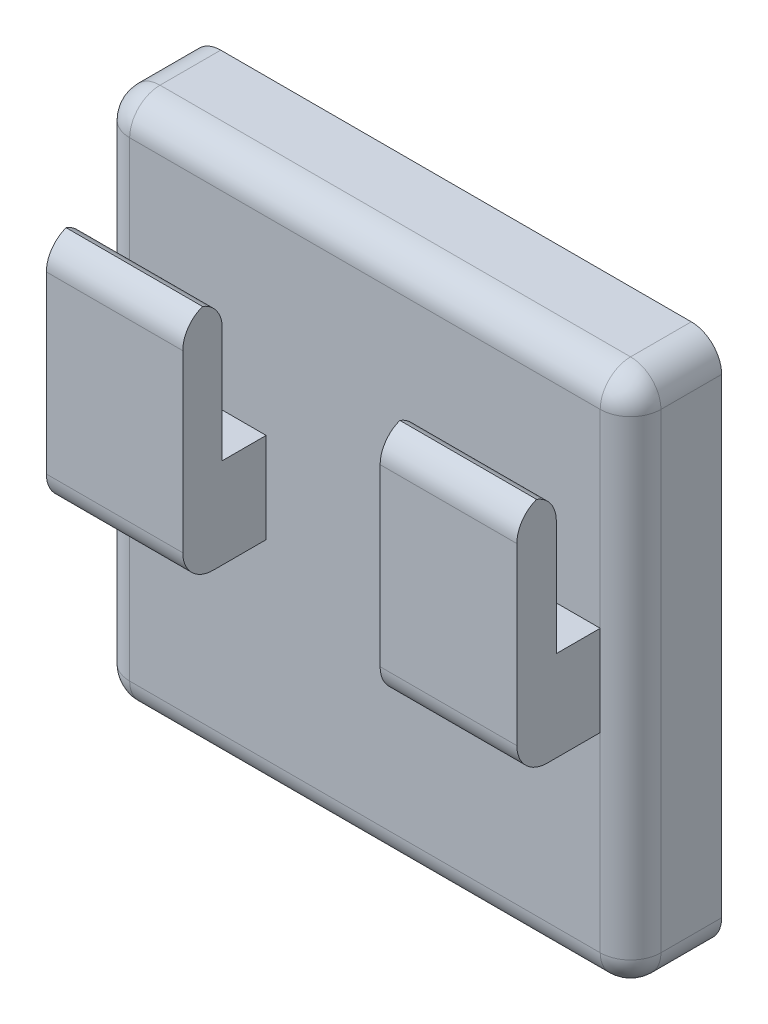
ISO-10303-21;
HEADER;
FILE_DESCRIPTION(('STEP AP214'),'2;1');
FILE_NAME('part.step','',(''),(''),'','','');
FILE_SCHEMA(('AUTOMOTIVE_DESIGN { 1 0 10303 214 1 1 1 1 }'));
ENDSEC;
DATA;
#1=APPLICATION_CONTEXT('core data for automotive mechanical design processes');
#2=APPLICATION_PROTOCOL_DEFINITION('international standard','automotive_design',2000,#1);
#3=PRODUCT_CONTEXT('',#1,'mechanical');
#4=PRODUCT('Part','Part','',(#3));
#5=PRODUCT_RELATED_PRODUCT_CATEGORY('part','',(#4));
#6=PRODUCT_DEFINITION_FORMATION('','',#4);
#7=PRODUCT_DEFINITION_CONTEXT('part definition',#1,'design');
#8=PRODUCT_DEFINITION('design','',#6,#7);
#9=PRODUCT_DEFINITION_SHAPE('','',#8);
#10=(LENGTH_UNIT() NAMED_UNIT(*) SI_UNIT(.MILLI.,.METRE.));
#11=(NAMED_UNIT(*) PLANE_ANGLE_UNIT() SI_UNIT($,.RADIAN.));
#12=(NAMED_UNIT(*) SI_UNIT($,.STERADIAN.) SOLID_ANGLE_UNIT());
#13=UNCERTAINTY_MEASURE_WITH_UNIT(LENGTH_MEASURE(1.E-05),#10,'distance_accuracy_value','');
#14=(GEOMETRIC_REPRESENTATION_CONTEXT(3) GLOBAL_UNCERTAINTY_ASSIGNED_CONTEXT((#13)) GLOBAL_UNIT_ASSIGNED_CONTEXT((#10,
#11,#12)) REPRESENTATION_CONTEXT('',''));
#15=CARTESIAN_POINT('',(0.,0.,0.));
#16=DIRECTION('',(0.,0.,1.));
#17=DIRECTION('',(1.,0.,0.));
#18=AXIS2_PLACEMENT_3D('',#15,#16,#17);
#19=CARTESIAN_POINT('',(44.45,34.4782802108625,0.));
#20=DIRECTION('',(0.,-1.,0.));
#21=DIRECTION('',(0.,0.,-1.));
#22=AXIS2_PLACEMENT_3D('',#19,#20,#21);
#23=PLANE('',#22);
#24=DIRECTION('',(0.,0.,1.));
#25=VECTOR('',#24,1.);
#26=CARTESIAN_POINT('',(13.958752929952,34.4782802108625,0.));
#27=LINE('',#26,#25);
#28=CARTESIAN_POINT('',(13.958752929952,34.4782802108625,11.7617244409826));
#29=VERTEX_POINT('',#28);
#30=CARTESIAN_POINT('',(13.958752929952,34.4782802108625,15.434687804273));
#31=VERTEX_POINT('',#30);
#32=EDGE_CURVE('E398',#29,#31,#27,.T.);
#33=ORIENTED_EDGE('',*,*,#32,.F.);
#34=DIRECTION('',(-1.,0.,0.));
#35=VECTOR('',#34,1.);
#36=CARTESIAN_POINT('',(44.45,34.4782802108625,11.7617244409826));
#37=LINE('',#36,#35);
#38=CARTESIAN_POINT('',(2.54496675491406,34.4782802108625,11.7617244409826));
#39=VERTEX_POINT('',#38);
#40=EDGE_CURVE('E249',#29,#39,#37,.T.);
#41=ORIENTED_EDGE('',*,*,#40,.T.);
#42=DIRECTION('',(0.,0.,-1.));
#43=VECTOR('',#42,1.);
#44=CARTESIAN_POINT('',(2.54496675491406,34.4782802108625,0.));
#45=LINE('',#44,#43);
#46=CARTESIAN_POINT('',(2.54496675491406,34.4782802108625,15.434687804273));
#47=VERTEX_POINT('',#46);
#48=EDGE_CURVE('E403',#47,#39,#45,.T.);
#49=ORIENTED_EDGE('',*,*,#48,.F.);
#50=DIRECTION('',(-1.,0.,0.));
#51=VECTOR('',#50,1.);
#52=CARTESIAN_POINT('',(44.45,34.4782802108625,15.434687804273));
#53=LINE('',#52,#51);
#54=EDGE_CURVE('E236',#31,#47,#53,.T.);
#55=ORIENTED_EDGE('',*,*,#54,.F.);
#56=EDGE_LOOP('',(#33,#41,#49,#55));
#57=FACE_BOUND('',#56,.T.);
#58=ADVANCED_FACE('F36',(#57),#23,.F.);
#59=DIRECTION('',(0.,0.,-1.));
#60=VECTOR('',#59,1.);
#61=CARTESIAN_POINT('',(30.4720294252056,34.4782802108625,0.));
#62=LINE('',#61,#60);
#63=CARTESIAN_POINT('',(30.4720294252056,34.4782802108625,15.434687804273));
#64=VERTEX_POINT('',#63);
#65=CARTESIAN_POINT('',(30.4720294252056,34.4782802108625,11.7617244409826));
#66=VERTEX_POINT('',#65);
#67=EDGE_CURVE('E225',#64,#66,#62,.T.);
#68=ORIENTED_EDGE('',*,*,#67,.F.);
#69=CARTESIAN_POINT('',(41.91,34.4782802108625,15.434687804273));
#70=VERTEX_POINT('',#69);
#71=EDGE_CURVE('E240',#70,#64,#53,.T.);
#72=ORIENTED_EDGE('',*,*,#71,.F.);
#73=DIRECTION('',(0.,0.,-1.));
#74=VECTOR('',#73,1.);
#75=CARTESIAN_POINT('',(41.91,34.4782802108625,0.));
#76=LINE('',#75,#74);
#77=CARTESIAN_POINT('',(41.91,34.4782802108625,11.7617244409826));
#78=VERTEX_POINT('',#77);
#79=EDGE_CURVE('E414',#70,#78,#76,.T.);
#80=ORIENTED_EDGE('',*,*,#79,.T.);
#81=EDGE_CURVE('E250',#78,#66,#37,.T.);
#82=ORIENTED_EDGE('',*,*,#81,.T.);
#83=EDGE_LOOP('',(#68,#72,#80,#82));
#84=FACE_BOUND('',#83,.T.);
#85=ADVANCED_FACE('F459',(#84),#23,.F.);
#86=CARTESIAN_POINT('',(44.45,0.,15.434687804273));
#87=DIRECTION('',(0.,0.,1.));
#88=DIRECTION('',(1.,0.,0.));
#89=AXIS2_PLACEMENT_3D('',#86,#87,#88);
#90=PLANE('',#89);
#91=DIRECTION('',(0.,-1.,0.));
#92=VECTOR('',#91,1.);
#93=CARTESIAN_POINT('',(2.54496675491406,0.,15.434687804273));
#94=LINE('',#93,#92);
#95=CARTESIAN_POINT('',(2.54496675491406,44.1039966018817,15.434687804273));
#96=VERTEX_POINT('',#95);
#97=EDGE_CURVE('E396',#96,#47,#94,.T.);
#98=ORIENTED_EDGE('',*,*,#97,.F.);
#99=DIRECTION('',(-1.,0.,0.));
#100=VECTOR('',#99,1.);
#101=CARTESIAN_POINT('',(13.958752929952,44.1039966018817,15.434687804273));
#102=LINE('',#101,#100);
#103=CARTESIAN_POINT('',(13.958752929952,44.1039966018817,15.434687804273));
#104=VERTEX_POINT('',#103);
#105=EDGE_CURVE('E362',#96,#104,#102,.F.);
#106=ORIENTED_EDGE('',*,*,#105,.T.);
#107=DIRECTION('',(0.,1.,0.));
#108=VECTOR('',#107,1.);
#109=CARTESIAN_POINT('',(13.958752929952,0.,15.434687804273));
#110=LINE('',#109,#108);
#111=EDGE_CURVE('E554',#31,#104,#110,.T.);
#112=ORIENTED_EDGE('',*,*,#111,.F.);
#113=ORIENTED_EDGE('',*,*,#54,.T.);
#114=EDGE_LOOP('',(#98,#106,#112,#113));
#115=FACE_BOUND('',#114,.T.);
#116=ADVANCED_FACE('F498',(#115),#90,.F.);
#117=DIRECTION('',(0.,-1.,0.));
#118=VECTOR('',#117,1.);
#119=CARTESIAN_POINT('',(30.4720294252056,0.,15.434687804273));
#120=LINE('',#119,#118);
#121=CARTESIAN_POINT('',(30.4720294252056,44.1039966018817,15.434687804273));
#122=VERTEX_POINT('',#121);
#123=EDGE_CURVE('E572',#122,#64,#120,.T.);
#124=ORIENTED_EDGE('',*,*,#123,.F.);
#125=DIRECTION('',(-1.,0.,0.));
#126=VECTOR('',#125,1.);
#127=CARTESIAN_POINT('',(41.91,44.1039966018817,15.434687804273));
#128=LINE('',#127,#126);
#129=CARTESIAN_POINT('',(41.91,44.1039966018817,15.434687804273));
#130=VERTEX_POINT('',#129);
#131=EDGE_CURVE('E348',#122,#130,#128,.F.);
#132=ORIENTED_EDGE('',*,*,#131,.T.);
#133=DIRECTION('',(0.,-1.,0.));
#134=VECTOR('',#133,1.);
#135=CARTESIAN_POINT('',(41.91,0.,15.434687804273));
#136=LINE('',#135,#134);
#137=EDGE_CURVE('E412',#130,#70,#136,.T.);
#138=ORIENTED_EDGE('',*,*,#137,.T.);
#139=ORIENTED_EDGE('',*,*,#71,.T.);
#140=EDGE_LOOP('',(#124,#132,#138,#139));
#141=FACE_BOUND('',#140,.T.);
#142=ADVANCED_FACE('F544',(#141),#90,.F.);
#143=CARTESIAN_POINT('',(44.45,0.,18.7372799059204));
#144=DIRECTION('',(0.,0.,1.));
#145=DIRECTION('',(1.,0.,0.));
#146=AXIS2_PLACEMENT_3D('',#143,#144,#145);
#147=PLANE('',#146);
#148=DIRECTION('',(0.,-1.,0.));
#149=VECTOR('',#148,1.);
#150=CARTESIAN_POINT('',(2.54496675491406,0.,18.7372799059204));
#151=LINE('',#150,#149);
#152=CARTESIAN_POINT('',(2.54496675491406,44.1039966018817,18.7372799059204));
#153=VERTEX_POINT('',#152);
#154=CARTESIAN_POINT('',(2.54496675491406,29.4613801806245,18.7372799059204));
#155=VERTEX_POINT('',#154);
#156=EDGE_CURVE('E394',#153,#155,#151,.T.);
#157=ORIENTED_EDGE('',*,*,#156,.T.);
#158=DIRECTION('',(-1.,0.,0.));
#159=VECTOR('',#158,1.);
#160=CARTESIAN_POINT('',(44.45,29.4613801806245,18.7372799059204));
#161=LINE('',#160,#159);
#162=CARTESIAN_POINT('',(13.958752929952,29.4613801806245,18.7372799059204));
#163=VERTEX_POINT('',#162);
#164=EDGE_CURVE('E44',#155,#163,#161,.F.);
#165=ORIENTED_EDGE('',*,*,#164,.T.);
#166=DIRECTION('',(0.,1.,0.));
#167=VECTOR('',#166,1.);
#168=CARTESIAN_POINT('',(13.958752929952,0.,18.7372799059204));
#169=LINE('',#168,#167);
#170=CARTESIAN_POINT('',(13.958752929952,44.1039966018817,18.7372799059204));
#171=VERTEX_POINT('',#170);
#172=EDGE_CURVE('E552',#163,#171,#169,.T.);
#173=ORIENTED_EDGE('',*,*,#172,.T.);
#174=DIRECTION('',(-1.,0.,0.));
#175=VECTOR('',#174,1.);
#176=CARTESIAN_POINT('',(44.45,44.1039966018817,18.7372799059204));
#177=LINE('',#176,#175);
#178=EDGE_CURVE('E350',#171,#153,#177,.T.);
#179=ORIENTED_EDGE('',*,*,#178,.T.);
#180=EDGE_LOOP('',(#157,#165,#173,#179));
#181=FACE_BOUND('',#180,.T.);
#182=ADVANCED_FACE('F542',(#181),#147,.T.);
#183=DIRECTION('',(0.,-1.,0.));
#184=VECTOR('',#183,1.);
#185=CARTESIAN_POINT('',(30.4720294252056,0.,18.7372799059204));
#186=LINE('',#185,#184);
#187=CARTESIAN_POINT('',(30.4720294252056,44.1039966018817,18.7372799059204));
#188=VERTEX_POINT('',#187);
#189=CARTESIAN_POINT('',(30.4720294252056,29.4613801806245,18.7372799059204));
#190=VERTEX_POINT('',#189);
#191=EDGE_CURVE('E219',#188,#190,#186,.T.);
#192=ORIENTED_EDGE('',*,*,#191,.T.);
#193=DIRECTION('',(-1.,0.,0.));
#194=VECTOR('',#193,1.);
#195=CARTESIAN_POINT('',(44.45,29.4613801806245,18.7372799059204));
#196=LINE('',#195,#194);
#197=CARTESIAN_POINT('',(41.91,29.4613801806245,18.7372799059204));
#198=VERTEX_POINT('',#197);
#199=EDGE_CURVE('E372',#190,#198,#196,.F.);
#200=ORIENTED_EDGE('',*,*,#199,.T.);
#201=DIRECTION('',(0.,-1.,0.));
#202=VECTOR('',#201,1.);
#203=CARTESIAN_POINT('',(41.91,0.,18.7372799059204));
#204=LINE('',#203,#202);
#205=CARTESIAN_POINT('',(41.91,44.1039966018817,18.7372799059204));
#206=VERTEX_POINT('',#205);
#207=EDGE_CURVE('E409',#206,#198,#204,.T.);
#208=ORIENTED_EDGE('',*,*,#207,.F.);
#209=DIRECTION('',(-1.,0.,0.));
#210=VECTOR('',#209,1.);
#211=CARTESIAN_POINT('',(44.45,44.1039966018817,18.7372799059204));
#212=LINE('',#211,#210);
#213=EDGE_CURVE('E326',#206,#188,#212,.T.);
#214=ORIENTED_EDGE('',*,*,#213,.T.);
#215=EDGE_LOOP('',(#192,#200,#208,#214));
#216=FACE_BOUND('',#215,.T.);
#217=ADVANCED_FACE('F541',(#216),#147,.T.);
#218=CARTESIAN_POINT('',(44.45,26.9213801806245,0.));
#219=DIRECTION('',(0.,-1.,0.));
#220=DIRECTION('',(0.,0.,-1.));
#221=AXIS2_PLACEMENT_3D('',#218,#219,#220);
#222=PLANE('',#221);
#223=DIRECTION('',(0.,0.,1.));
#224=VECTOR('',#223,1.);
#225=CARTESIAN_POINT('',(13.958752929952,26.9213801806245,0.));
#226=LINE('',#225,#224);
#227=CARTESIAN_POINT('',(13.958752929952,26.9213801806245,11.7617244409826));
#228=VERTEX_POINT('',#227);
#229=CARTESIAN_POINT('',(13.958752929952,26.9213801806245,16.1972799059204));
#230=VERTEX_POINT('',#229);
#231=EDGE_CURVE('E386',#228,#230,#226,.T.);
#232=ORIENTED_EDGE('',*,*,#231,.T.);
#233=DIRECTION('',(-1.,0.,0.));
#234=VECTOR('',#233,1.);
#235=CARTESIAN_POINT('',(44.45,26.9213801806245,16.1972799059204));
#236=LINE('',#235,#234);
#237=CARTESIAN_POINT('',(2.54496675491406,26.9213801806245,16.1972799059204));
#238=VERTEX_POINT('',#237);
#239=EDGE_CURVE('E376',#230,#238,#236,.T.);
#240=ORIENTED_EDGE('',*,*,#239,.T.);
#241=DIRECTION('',(0.,0.,-1.));
#242=VECTOR('',#241,1.);
#243=CARTESIAN_POINT('',(2.54496675491406,26.9213801806245,0.));
#244=LINE('',#243,#242);
#245=CARTESIAN_POINT('',(2.54496675491406,26.9213801806245,11.7617244409826));
#246=VERTEX_POINT('',#245);
#247=EDGE_CURVE('E384',#238,#246,#244,.T.);
#248=ORIENTED_EDGE('',*,*,#247,.T.);
#249=DIRECTION('',(-1.,0.,0.));
#250=VECTOR('',#249,1.);
#251=CARTESIAN_POINT('',(44.45,26.9213801806245,11.7617244409826));
#252=LINE('',#251,#250);
#253=EDGE_CURVE('E237',#228,#246,#252,.T.);
#254=ORIENTED_EDGE('',*,*,#253,.F.);
#255=EDGE_LOOP('',(#232,#240,#248,#254));
#256=FACE_BOUND('',#255,.T.);
#257=ADVANCED_FACE('F382',(#256),#222,.T.);
#258=DIRECTION('',(0.,0.,-1.));
#259=VECTOR('',#258,1.);
#260=CARTESIAN_POINT('',(41.91,26.9213801806245,0.));
#261=LINE('',#260,#259);
#262=CARTESIAN_POINT('',(41.91,26.9213801806245,16.1972799059204));
#263=VERTEX_POINT('',#262);
#264=CARTESIAN_POINT('',(41.91,26.9213801806245,11.7617244409826));
#265=VERTEX_POINT('',#264);
#266=EDGE_CURVE('E407',#263,#265,#261,.T.);
#267=ORIENTED_EDGE('',*,*,#266,.F.);
#268=DIRECTION('',(-1.,0.,0.));
#269=VECTOR('',#268,1.);
#270=CARTESIAN_POINT('',(44.45,26.9213801806245,16.1972799059204));
#271=LINE('',#270,#269);
#272=CARTESIAN_POINT('',(30.4720294252056,26.9213801806245,16.1972799059204));
#273=VERTEX_POINT('',#272);
#274=EDGE_CURVE('E217',#263,#273,#271,.T.);
#275=ORIENTED_EDGE('',*,*,#274,.T.);
#276=DIRECTION('',(0.,0.,-1.));
#277=VECTOR('',#276,1.);
#278=CARTESIAN_POINT('',(30.4720294252056,26.9213801806245,0.));
#279=LINE('',#278,#277);
#280=CARTESIAN_POINT('',(30.4720294252056,26.9213801806245,11.7617244409826));
#281=VERTEX_POINT('',#280);
#282=EDGE_CURVE('E209',#273,#281,#279,.T.);
#283=ORIENTED_EDGE('',*,*,#282,.T.);
#284=EDGE_CURVE('E214',#265,#281,#252,.T.);
#285=ORIENTED_EDGE('',*,*,#284,.F.);
#286=EDGE_LOOP('',(#267,#275,#283,#285));
#287=FACE_BOUND('',#286,.T.);
#288=ADVANCED_FACE('F212',(#287),#222,.T.);
#289=CARTESIAN_POINT('',(0.,0.,0.));
#290=DIRECTION('',(1.,0.,0.));
#291=DIRECTION('',(0.,0.,-1.));
#292=AXIS2_PLACEMENT_3D('',#289,#290,#291);
#293=PLANE('',#292);
#294=DIRECTION('',(0.,-1.,0.));
#295=VECTOR('',#294,1.);
#296=CARTESIAN_POINT('',(0.,0.,9.22172444098261));
#297=LINE('',#296,#295);
#298=CARTESIAN_POINT('',(0.,10.964900439516,9.22172444098261));
#299=VERTEX_POINT('',#298);
#300=CARTESIAN_POINT('',(0.,50.334900439516,9.22172444098261));
#301=VERTEX_POINT('',#300);
#302=EDGE_CURVE('E279',#299,#301,#297,.F.);
#303=ORIENTED_EDGE('',*,*,#302,.T.);
#304=DIRECTION('',(0.,0.,-1.));
#305=VECTOR('',#304,1.);
#306=CARTESIAN_POINT('',(0.,50.334900439516,4.14172444098261));
#307=LINE('',#306,#305);
#308=CARTESIAN_POINT('',(0.,50.334900439516,4.14172444098261));
#309=VERTEX_POINT('',#308);
#310=EDGE_CURVE('E285',#301,#309,#307,.T.);
#311=ORIENTED_EDGE('',*,*,#310,.T.);
#312=DIRECTION('',(0.,-1.,0.));
#313=VECTOR('',#312,1.);
#314=CARTESIAN_POINT('',(0.,0.,4.14172444098261));
#315=LINE('',#314,#313);
#316=CARTESIAN_POINT('',(0.,10.964900439516,4.14172444098261));
#317=VERTEX_POINT('',#316);
#318=EDGE_CURVE('E245',#309,#317,#315,.T.);
#319=ORIENTED_EDGE('',*,*,#318,.T.);
#320=DIRECTION('',(0.,0.,1.));
#321=VECTOR('',#320,1.);
#322=CARTESIAN_POINT('',(0.,10.964900439516,9.22172444098261));
#323=LINE('',#322,#321);
#324=EDGE_CURVE('E282',#317,#299,#323,.T.);
#325=ORIENTED_EDGE('',*,*,#324,.T.);
#326=EDGE_LOOP('',(#303,#311,#319,#325));
#327=FACE_BOUND('',#326,.T.);
#328=ADVANCED_FACE('F424',(#327),#293,.F.);
#329=CARTESIAN_POINT('',(44.45,0.,0.));
#330=DIRECTION('',(1.,0.,0.));
#331=DIRECTION('',(0.,0.,-1.));
#332=AXIS2_PLACEMENT_3D('',#329,#330,#331);
#333=PLANE('',#332);
#334=DIRECTION('',(0.,-1.,0.));
#335=VECTOR('',#334,1.);
#336=CARTESIAN_POINT('',(44.45,8.424900439516,9.22172444098261));
#337=LINE('',#336,#335);
#338=CARTESIAN_POINT('',(44.45,50.334900439516,9.22172444098261));
#339=VERTEX_POINT('',#338);
#340=CARTESIAN_POINT('',(44.45,10.964900439516,9.22172444098261));
#341=VERTEX_POINT('',#340);
#342=EDGE_CURVE('E276',#339,#341,#337,.T.);
#343=ORIENTED_EDGE('',*,*,#342,.T.);
#344=DIRECTION('',(0.,0.,1.));
#345=VECTOR('',#344,1.);
#346=CARTESIAN_POINT('',(44.45,10.964900439516,0.));
#347=LINE('',#346,#345);
#348=CARTESIAN_POINT('',(44.45,10.964900439516,4.14172444098261));
#349=VERTEX_POINT('',#348);
#350=EDGE_CURVE('E308',#341,#349,#347,.F.);
#351=ORIENTED_EDGE('',*,*,#350,.T.);
#352=DIRECTION('',(0.,-1.,0.));
#353=VECTOR('',#352,1.);
#354=CARTESIAN_POINT('',(44.45,0.,4.14172444098261));
#355=LINE('',#354,#353);
#356=CARTESIAN_POINT('',(44.45,50.334900439516,4.14172444098261));
#357=VERTEX_POINT('',#356);
#358=EDGE_CURVE('E243',#357,#349,#355,.T.);
#359=ORIENTED_EDGE('',*,*,#358,.F.);
#360=DIRECTION('',(0.,0.,-1.));
#361=VECTOR('',#360,1.);
#362=CARTESIAN_POINT('',(44.45,50.334900439516,0.));
#363=LINE('',#362,#361);
#364=EDGE_CURVE('E306',#357,#339,#363,.F.);
#365=ORIENTED_EDGE('',*,*,#364,.T.);
#366=EDGE_LOOP('',(#343,#351,#359,#365));
#367=FACE_BOUND('',#366,.T.);
#368=ADVANCED_FACE('F509',(#367),#333,.T.);
#369=CARTESIAN_POINT('',(44.45,8.424900439516,0.));
#370=DIRECTION('',(0.,-1.,0.));
#371=DIRECTION('',(0.,0.,-1.));
#372=AXIS2_PLACEMENT_3D('',#369,#370,#371);
#373=PLANE('',#372);
#374=DIRECTION('',(-1.,0.,0.));
#375=VECTOR('',#374,1.);
#376=CARTESIAN_POINT('',(0.,8.424900439516,9.22172444098261));
#377=LINE('',#376,#375);
#378=CARTESIAN_POINT('',(41.91,8.424900439516,9.22172444098261));
#379=VERTEX_POINT('',#378);
#380=CARTESIAN_POINT('',(2.54,8.424900439516,9.22172444098261));
#381=VERTEX_POINT('',#380);
#382=EDGE_CURVE('E258',#379,#381,#377,.T.);
#383=ORIENTED_EDGE('',*,*,#382,.T.);
#384=DIRECTION('',(0.,0.,1.));
#385=VECTOR('',#384,1.);
#386=CARTESIAN_POINT('',(2.54,8.424900439516,4.14172444098261));
#387=LINE('',#386,#385);
#388=CARTESIAN_POINT('',(2.54,8.424900439516,4.14172444098261));
#389=VERTEX_POINT('',#388);
#390=EDGE_CURVE('E304',#381,#389,#387,.F.);
#391=ORIENTED_EDGE('',*,*,#390,.T.);
#392=DIRECTION('',(-1.,0.,0.));
#393=VECTOR('',#392,1.);
#394=CARTESIAN_POINT('',(44.45,8.424900439516,4.14172444098261));
#395=LINE('',#394,#393);
#396=CARTESIAN_POINT('',(41.91,8.424900439516,4.14172444098261));
#397=VERTEX_POINT('',#396);
#398=EDGE_CURVE('E255',#397,#389,#395,.T.);
#399=ORIENTED_EDGE('',*,*,#398,.F.);
#400=DIRECTION('',(0.,0.,1.));
#401=VECTOR('',#400,1.);
#402=CARTESIAN_POINT('',(41.91,8.424900439516,0.));
#403=LINE('',#402,#401);
#404=EDGE_CURVE('E301',#397,#379,#403,.T.);
#405=ORIENTED_EDGE('',*,*,#404,.T.);
#406=EDGE_LOOP('',(#383,#391,#399,#405));
#407=FACE_BOUND('',#406,.T.);
#408=ADVANCED_FACE('F507',(#407),#373,.T.);
#409=CARTESIAN_POINT('',(44.45,0.,4.14172444098261));
#410=DIRECTION('',(0.,0.,-1.));
#411=DIRECTION('',(0.,1.,0.));
#412=AXIS2_PLACEMENT_3D('',#409,#410,#411);
#413=PLANE('',#412);
#414=ORIENTED_EDGE('',*,*,#318,.F.);
#415=CARTESIAN_POINT('',(2.54,50.334900439516,4.14172444098261));
#416=DIRECTION('',(0.,0.,-1.));
#417=DIRECTION('',(0.,1.,0.));
#418=AXIS2_PLACEMENT_3D('',#415,#416,#417);
#419=CIRCLE('',#418,2.54);
#420=CARTESIAN_POINT('',(2.54,52.874900439516,4.14172444098261));
#421=VERTEX_POINT('',#420);
#422=EDGE_CURVE('E294',#309,#421,#419,.T.);
#423=ORIENTED_EDGE('',*,*,#422,.T.);
#424=DIRECTION('',(-1.,0.,0.));
#425=VECTOR('',#424,1.);
#426=CARTESIAN_POINT('',(44.45,52.874900439516,4.14172444098261));
#427=LINE('',#426,#425);
#428=CARTESIAN_POINT('',(41.91,52.874900439516,4.14172444098261));
#429=VERTEX_POINT('',#428);
#430=EDGE_CURVE('E252',#429,#421,#427,.T.);
#431=ORIENTED_EDGE('',*,*,#430,.F.);
#432=CARTESIAN_POINT('',(41.91,50.334900439516,4.14172444098261));
#433=DIRECTION('',(0.,0.,-1.));
#434=DIRECTION('',(0.,1.,0.));
#435=AXIS2_PLACEMENT_3D('',#432,#433,#434);
#436=CIRCLE('',#435,2.54);
#437=EDGE_CURVE('E288',#429,#357,#436,.T.);
#438=ORIENTED_EDGE('',*,*,#437,.T.);
#439=ORIENTED_EDGE('',*,*,#358,.T.);
#440=CARTESIAN_POINT('',(41.91,10.964900439516,4.14172444098261));
#441=DIRECTION('',(0.,0.,-1.));
#442=DIRECTION('',(0.,1.,0.));
#443=AXIS2_PLACEMENT_3D('',#440,#441,#442);
#444=CIRCLE('',#443,2.54);
#445=EDGE_CURVE('E290',#349,#397,#444,.T.);
#446=ORIENTED_EDGE('',*,*,#445,.T.);
#447=ORIENTED_EDGE('',*,*,#398,.T.);
#448=CARTESIAN_POINT('',(2.54,10.964900439516,4.14172444098261));
#449=DIRECTION('',(0.,0.,-1.));
#450=DIRECTION('',(0.,1.,0.));
#451=AXIS2_PLACEMENT_3D('',#448,#449,#450);
#452=CIRCLE('',#451,2.54);
#453=EDGE_CURVE('E292',#389,#317,#452,.T.);
#454=ORIENTED_EDGE('',*,*,#453,.T.);
#455=EDGE_LOOP('',(#414,#423,#431,#438,#439,#446,#447,#454));
#456=FACE_BOUND('',#455,.T.);
#457=ADVANCED_FACE('F477',(#456),#413,.T.);
#458=CARTESIAN_POINT('',(44.45,52.874900439516,0.));
#459=DIRECTION('',(0.,1.,0.));
#460=DIRECTION('',(0.,0.,1.));
#461=AXIS2_PLACEMENT_3D('',#458,#459,#460);
#462=PLANE('',#461);
#463=ORIENTED_EDGE('',*,*,#430,.T.);
#464=DIRECTION('',(0.,0.,-1.));
#465=VECTOR('',#464,1.);
#466=CARTESIAN_POINT('',(2.54,52.874900439516,9.22172444098261));
#467=LINE('',#466,#465);
#468=CARTESIAN_POINT('',(2.54,52.874900439516,9.22172444098261));
#469=VERTEX_POINT('',#468);
#470=EDGE_CURVE('E299',#421,#469,#467,.F.);
#471=ORIENTED_EDGE('',*,*,#470,.T.);
#472=DIRECTION('',(-1.,0.,0.));
#473=VECTOR('',#472,1.);
#474=CARTESIAN_POINT('',(44.45,52.874900439516,9.22172444098261));
#475=LINE('',#474,#473);
#476=CARTESIAN_POINT('',(41.91,52.874900439516,9.22172444098261));
#477=VERTEX_POINT('',#476);
#478=EDGE_CURVE('E273',#469,#477,#475,.F.);
#479=ORIENTED_EDGE('',*,*,#478,.T.);
#480=DIRECTION('',(0.,0.,-1.));
#481=VECTOR('',#480,1.);
#482=CARTESIAN_POINT('',(41.91,52.874900439516,0.));
#483=LINE('',#482,#481);
#484=EDGE_CURVE('E296',#477,#429,#483,.T.);
#485=ORIENTED_EDGE('',*,*,#484,.T.);
#486=EDGE_LOOP('',(#463,#471,#479,#485));
#487=FACE_BOUND('',#486,.T.);
#488=ADVANCED_FACE('F475',(#487),#462,.T.);
#489=CARTESIAN_POINT('',(44.45,0.,11.7617244409826));
#490=DIRECTION('',(0.,0.,-1.));
#491=DIRECTION('',(-1.,0.,0.));
#492=AXIS2_PLACEMENT_3D('',#489,#490,#491);
#493=PLANE('',#492);
#494=ORIENTED_EDGE('',*,*,#40,.F.);
#495=DIRECTION('',(0.,-1.,0.));
#496=VECTOR('',#495,1.);
#497=CARTESIAN_POINT('',(13.958752929952,46.6439966018817,11.7617244409826));
#498=LINE('',#497,#496);
#499=EDGE_CURVE('E229',#29,#228,#498,.T.);
#500=ORIENTED_EDGE('',*,*,#499,.T.);
#501=ORIENTED_EDGE('',*,*,#253,.T.);
#502=DIRECTION('',(0.,1.,0.));
#503=VECTOR('',#502,1.);
#504=CARTESIAN_POINT('',(2.54496675491406,46.6439966018817,11.7617244409826));
#505=LINE('',#504,#503);
#506=EDGE_CURVE('E393',#246,#39,#505,.T.);
#507=ORIENTED_EDGE('',*,*,#506,.T.);
#508=EDGE_LOOP('',(#494,#500,#501,#507));
#509=FACE_BOUND('',#508,.T.);
#510=DIRECTION('',(-1.,0.,0.));
#511=VECTOR('',#510,1.);
#512=CARTESIAN_POINT('',(44.45,10.964900439516,11.7617244409826));
#513=LINE('',#512,#511);
#514=CARTESIAN_POINT('',(2.54,10.964900439516,11.7617244409826));
#515=VERTEX_POINT('',#514);
#516=CARTESIAN_POINT('',(41.91,10.964900439516,11.7617244409826));
#517=VERTEX_POINT('',#516);
#518=EDGE_CURVE('E267',#515,#517,#513,.F.);
#519=ORIENTED_EDGE('',*,*,#518,.T.);
#520=DIRECTION('',(0.,-1.,0.));
#521=VECTOR('',#520,1.);
#522=CARTESIAN_POINT('',(41.91,52.874900439516,11.7617244409826));
#523=LINE('',#522,#521);
#524=EDGE_CURVE('E235',#517,#265,#523,.F.);
#525=ORIENTED_EDGE('',*,*,#524,.T.);
#526=ORIENTED_EDGE('',*,*,#284,.T.);
#527=DIRECTION('',(0.,1.,0.));
#528=VECTOR('',#527,1.);
#529=CARTESIAN_POINT('',(30.4720294252056,46.6439966018817,11.7617244409826));
#530=LINE('',#529,#528);
#531=EDGE_CURVE('E220',#281,#66,#530,.T.);
#532=ORIENTED_EDGE('',*,*,#531,.T.);
#533=ORIENTED_EDGE('',*,*,#81,.F.);
#534=DIRECTION('',(0.,-1.,0.));
#535=VECTOR('',#534,1.);
#536=CARTESIAN_POINT('',(41.91,52.874900439516,11.7617244409826));
#537=LINE('',#536,#535);
#538=CARTESIAN_POINT('',(41.91,50.334900439516,11.7617244409826));
#539=VERTEX_POINT('',#538);
#540=EDGE_CURVE('E269',#78,#539,#537,.F.);
#541=ORIENTED_EDGE('',*,*,#540,.T.);
#542=DIRECTION('',(-1.,0.,0.));
#543=VECTOR('',#542,1.);
#544=CARTESIAN_POINT('',(0.,50.334900439516,11.7617244409826));
#545=LINE('',#544,#543);
#546=CARTESIAN_POINT('',(2.54,50.334900439516,11.7617244409826));
#547=VERTEX_POINT('',#546);
#548=EDGE_CURVE('E264',#539,#547,#545,.T.);
#549=ORIENTED_EDGE('',*,*,#548,.T.);
#550=DIRECTION('',(0.,-1.,0.));
#551=VECTOR('',#550,1.);
#552=CARTESIAN_POINT('',(2.54,0.,11.7617244409826));
#553=LINE('',#552,#551);
#554=EDGE_CURVE('E261',#547,#515,#553,.T.);
#555=ORIENTED_EDGE('',*,*,#554,.T.);
#556=EDGE_LOOP('',(#519,#525,#526,#532,#533,#541,#549,#555));
#557=FACE_BOUND('',#556,.T.);
#558=ADVANCED_FACE('F233',(#509,#557),#493,.F.);
#559=CARTESIAN_POINT('',(41.91,46.6439966018817,11.7617244409826));
#560=DIRECTION('',(-1.,0.,0.));
#561=DIRECTION('',(0.,0.,1.));
#562=AXIS2_PLACEMENT_3D('',#559,#560,#561);
#563=PLANE('',#562);
#564=ORIENTED_EDGE('',*,*,#207,.T.);
#565=CARTESIAN_POINT('',(41.91,29.4613801806245,16.1972799059204));
#566=DIRECTION('',(-1.,0.,0.));
#567=DIRECTION('',(0.,0.,1.));
#568=AXIS2_PLACEMENT_3D('',#565,#566,#567);
#569=CIRCLE('',#568,2.54);
#570=EDGE_CURVE('E374',#198,#263,#569,.F.);
#571=ORIENTED_EDGE('',*,*,#570,.T.);
#572=ORIENTED_EDGE('',*,*,#266,.T.);
#573=DIRECTION('',(0.,-1.,0.));
#574=VECTOR('',#573,1.);
#575=CARTESIAN_POINT('',(41.91,46.6439966018817,11.7617244409826));
#576=LINE('',#575,#574);
#577=EDGE_CURVE('E405',#78,#265,#576,.T.);
#578=ORIENTED_EDGE('',*,*,#577,.F.);
#579=ORIENTED_EDGE('',*,*,#79,.F.);
#580=ORIENTED_EDGE('',*,*,#137,.F.);
#581=CARTESIAN_POINT('',(41.91,44.1039966018817,17.974687804273));
#582=DIRECTION('',(-1.,0.,0.));
#583=DIRECTION('',(0.,0.,1.));
#584=AXIS2_PLACEMENT_3D('',#581,#582,#583);
#585=CIRCLE('',#584,2.54);
#586=CARTESIAN_POINT('',(41.91,46.4834514324508,17.0859838550967));
#587=VERTEX_POINT('',#586);
#588=EDGE_CURVE('E344',#130,#587,#585,.F.);
#589=ORIENTED_EDGE('',*,*,#588,.T.);
#590=CARTESIAN_POINT('',(41.91,44.1039966018817,16.1972799059204));
#591=DIRECTION('',(-1.,0.,0.));
#592=DIRECTION('',(0.,0.,1.));
#593=AXIS2_PLACEMENT_3D('',#590,#591,#592);
#594=CIRCLE('',#593,2.54);
#595=EDGE_CURVE('E346',#587,#206,#594,.F.);
#596=ORIENTED_EDGE('',*,*,#595,.T.);
#597=EDGE_LOOP('',(#564,#571,#572,#578,#579,#580,#589,#596));
#598=FACE_BOUND('',#597,.T.);
#599=ADVANCED_FACE('F455',(#598),#563,.F.);
#600=CARTESIAN_POINT('',(2.54496675491406,46.6439966018817,20.6517244409826));
#601=DIRECTION('',(-1.,0.,0.));
#602=DIRECTION('',(0.,0.,1.));
#603=AXIS2_PLACEMENT_3D('',#600,#601,#602);
#604=PLANE('',#603);
#605=ORIENTED_EDGE('',*,*,#247,.F.);
#606=CARTESIAN_POINT('',(2.54496675491406,29.4613801806245,16.1972799059204));
#607=DIRECTION('',(-1.,0.,0.));
#608=DIRECTION('',(0.,0.,1.));
#609=AXIS2_PLACEMENT_3D('',#606,#607,#608);
#610=CIRCLE('',#609,2.54);
#611=EDGE_CURVE('E58',#238,#155,#610,.T.);
#612=ORIENTED_EDGE('',*,*,#611,.T.);
#613=ORIENTED_EDGE('',*,*,#156,.F.);
#614=CARTESIAN_POINT('',(2.54496675491406,44.1039966018817,16.1972799059204));
#615=DIRECTION('',(-1.,0.,0.));
#616=DIRECTION('',(0.,0.,1.));
#617=AXIS2_PLACEMENT_3D('',#614,#615,#616);
#618=CIRCLE('',#617,2.54);
#619=CARTESIAN_POINT('',(2.54496675491406,46.4834514324508,17.0859838550967));
#620=VERTEX_POINT('',#619);
#621=EDGE_CURVE('E355',#153,#620,#618,.T.);
#622=ORIENTED_EDGE('',*,*,#621,.T.);
#623=CARTESIAN_POINT('',(2.54496675491406,44.1039966018817,17.974687804273));
#624=DIRECTION('',(-1.,0.,0.));
#625=DIRECTION('',(0.,0.,1.));
#626=AXIS2_PLACEMENT_3D('',#623,#624,#625);
#627=CIRCLE('',#626,2.54);
#628=EDGE_CURVE('E353',#620,#96,#627,.T.);
#629=ORIENTED_EDGE('',*,*,#628,.T.);
#630=ORIENTED_EDGE('',*,*,#97,.T.);
#631=ORIENTED_EDGE('',*,*,#48,.T.);
#632=ORIENTED_EDGE('',*,*,#506,.F.);
#633=EDGE_LOOP('',(#605,#612,#613,#622,#629,#630,#631,#632));
#634=FACE_BOUND('',#633,.T.);
#635=ADVANCED_FACE('F390',(#634),#604,.T.);
#636=CARTESIAN_POINT('',(13.958752929952,46.6439966018817,20.6517244409826));
#637=DIRECTION('',(1.,0.,0.));
#638=DIRECTION('',(0.,0.,-1.));
#639=AXIS2_PLACEMENT_3D('',#636,#637,#638);
#640=PLANE('',#639);
#641=ORIENTED_EDGE('',*,*,#172,.F.);
#642=CARTESIAN_POINT('',(13.958752929952,29.4613801806245,16.1972799059204));
#643=DIRECTION('',(1.,0.,0.));
#644=DIRECTION('',(0.,0.,-1.));
#645=AXIS2_PLACEMENT_3D('',#642,#643,#644);
#646=CIRCLE('',#645,2.54);
#647=EDGE_CURVE('E11',#163,#230,#646,.T.);
#648=ORIENTED_EDGE('',*,*,#647,.T.);
#649=ORIENTED_EDGE('',*,*,#231,.F.);
#650=ORIENTED_EDGE('',*,*,#499,.F.);
#651=ORIENTED_EDGE('',*,*,#32,.T.);
#652=ORIENTED_EDGE('',*,*,#111,.T.);
#653=CARTESIAN_POINT('',(13.958752929952,44.1039966018817,17.974687804273));
#654=DIRECTION('',(1.,0.,0.));
#655=DIRECTION('',(0.,0.,-1.));
#656=AXIS2_PLACEMENT_3D('',#653,#654,#655);
#657=CIRCLE('',#656,2.54);
#658=CARTESIAN_POINT('',(13.958752929952,46.4834514324508,17.0859838550967));
#659=VERTEX_POINT('',#658);
#660=EDGE_CURVE('E357',#104,#659,#657,.T.);
#661=ORIENTED_EDGE('',*,*,#660,.T.);
#662=CARTESIAN_POINT('',(13.958752929952,44.1039966018817,16.1972799059204));
#663=DIRECTION('',(1.,0.,0.));
#664=DIRECTION('',(0.,0.,-1.));
#665=AXIS2_PLACEMENT_3D('',#662,#663,#664);
#666=CIRCLE('',#665,2.54);
#667=EDGE_CURVE('E359',#659,#171,#666,.T.);
#668=ORIENTED_EDGE('',*,*,#667,.T.);
#669=EDGE_LOOP('',(#641,#648,#649,#650,#651,#652,#661,#668));
#670=FACE_BOUND('',#669,.T.);
#671=ADVANCED_FACE('F520',(#670),#640,.T.);
#672=CARTESIAN_POINT('',(30.4720294252056,46.6439966018817,20.6517244409826));
#673=DIRECTION('',(-1.,0.,0.));
#674=DIRECTION('',(0.,0.,1.));
#675=AXIS2_PLACEMENT_3D('',#672,#673,#674);
#676=PLANE('',#675);
#677=ORIENTED_EDGE('',*,*,#282,.F.);
#678=CARTESIAN_POINT('',(30.4720294252056,29.4613801806245,16.1972799059204));
#679=DIRECTION('',(-1.,0.,0.));
#680=DIRECTION('',(0.,0.,1.));
#681=AXIS2_PLACEMENT_3D('',#678,#679,#680);
#682=CIRCLE('',#681,2.54);
#683=EDGE_CURVE('E370',#273,#190,#682,.T.);
#684=ORIENTED_EDGE('',*,*,#683,.T.);
#685=ORIENTED_EDGE('',*,*,#191,.F.);
#686=CARTESIAN_POINT('',(30.4720294252056,44.1039966018817,16.1972799059204));
#687=DIRECTION('',(-1.,0.,0.));
#688=DIRECTION('',(0.,0.,1.));
#689=AXIS2_PLACEMENT_3D('',#686,#687,#688);
#690=CIRCLE('',#689,2.54);
#691=CARTESIAN_POINT('',(30.4720294252056,46.4834514324508,17.0859838550967));
#692=VERTEX_POINT('',#691);
#693=EDGE_CURVE('E342',#188,#692,#690,.T.);
#694=ORIENTED_EDGE('',*,*,#693,.T.);
#695=CARTESIAN_POINT('',(30.4720294252056,44.1039966018817,17.974687804273));
#696=DIRECTION('',(-1.,0.,0.));
#697=DIRECTION('',(0.,0.,1.));
#698=AXIS2_PLACEMENT_3D('',#695,#696,#697);
#699=CIRCLE('',#698,2.54);
#700=EDGE_CURVE('E340',#692,#122,#699,.T.);
#701=ORIENTED_EDGE('',*,*,#700,.T.);
#702=ORIENTED_EDGE('',*,*,#123,.T.);
#703=ORIENTED_EDGE('',*,*,#67,.T.);
#704=ORIENTED_EDGE('',*,*,#531,.F.);
#705=EDGE_LOOP('',(#677,#684,#685,#694,#701,#702,#703,#704));
#706=FACE_BOUND('',#705,.T.);
#707=ADVANCED_FACE('F223',(#706),#676,.T.);
#708=CARTESIAN_POINT('',(44.45,50.334900439516,9.22172444098261));
#709=DIRECTION('',(1.,0.,0.));
#710=DIRECTION('',(0.,0.,-1.));
#711=AXIS2_PLACEMENT_3D('',#708,#709,#710);
#712=CYLINDRICAL_SURFACE('',#711,2.54);
#713=ORIENTED_EDGE('',*,*,#478,.F.);
#714=CARTESIAN_POINT('',(2.54,50.334900439516,9.22172444098261));
#715=DIRECTION('',(1.,0.,0.));
#716=DIRECTION('',(0.,0.,-1.));
#717=AXIS2_PLACEMENT_3D('',#714,#715,#716);
#718=CIRCLE('',#717,2.54);
#719=EDGE_CURVE('E316',#469,#547,#718,.T.);
#720=ORIENTED_EDGE('',*,*,#719,.T.);
#721=ORIENTED_EDGE('',*,*,#548,.F.);
#722=CARTESIAN_POINT('',(41.91,50.334900439516,9.22172444098261));
#723=DIRECTION('',(1.,0.,0.));
#724=DIRECTION('',(0.,0.,-1.));
#725=AXIS2_PLACEMENT_3D('',#722,#723,#724);
#726=CIRCLE('',#725,2.54);
#727=EDGE_CURVE('E314',#539,#477,#726,.F.);
#728=ORIENTED_EDGE('',*,*,#727,.T.);
#729=EDGE_LOOP('',(#713,#720,#721,#728));
#730=FACE_BOUND('',#729,.T.);
#731=ADVANCED_FACE('F463',(#730),#712,.T.);
#732=CARTESIAN_POINT('',(41.91,0.,9.22172444098261));
#733=DIRECTION('',(0.,1.,0.));
#734=DIRECTION('',(0.,0.,1.));
#735=AXIS2_PLACEMENT_3D('',#732,#733,#734);
#736=CYLINDRICAL_SURFACE('',#735,2.54);
#737=ORIENTED_EDGE('',*,*,#524,.F.);
#738=CARTESIAN_POINT('',(41.91,10.964900439516,9.22172444098261));
#739=DIRECTION('',(0.,1.,0.));
#740=DIRECTION('',(0.,0.,1.));
#741=AXIS2_PLACEMENT_3D('',#738,#739,#740);
#742=CIRCLE('',#741,2.54);
#743=EDGE_CURVE('E324',#517,#341,#742,.T.);
#744=ORIENTED_EDGE('',*,*,#743,.T.);
#745=ORIENTED_EDGE('',*,*,#342,.F.);
#746=CARTESIAN_POINT('',(41.91,50.334900439516,9.22172444098261));
#747=DIRECTION('',(0.,1.,0.));
#748=DIRECTION('',(0.,0.,1.));
#749=AXIS2_PLACEMENT_3D('',#746,#747,#748);
#750=CIRCLE('',#749,2.54);
#751=EDGE_CURVE('E322',#339,#539,#750,.F.);
#752=ORIENTED_EDGE('',*,*,#751,.T.);
#753=ORIENTED_EDGE('',*,*,#540,.F.);
#754=ORIENTED_EDGE('',*,*,#577,.T.);
#755=EDGE_LOOP('',(#737,#744,#745,#752,#753,#754));
#756=FACE_BOUND('',#755,.T.);
#757=ADVANCED_FACE('F450',(#756),#736,.T.);
#758=CARTESIAN_POINT('',(2.54,0.,9.22172444098261));
#759=DIRECTION('',(0.,-1.,0.));
#760=DIRECTION('',(0.,0.,-1.));
#761=AXIS2_PLACEMENT_3D('',#758,#759,#760);
#762=CYLINDRICAL_SURFACE('',#761,2.54);
#763=ORIENTED_EDGE('',*,*,#554,.F.);
#764=CARTESIAN_POINT('',(2.54,50.334900439516,9.22172444098261));
#765=DIRECTION('',(0.,-1.,0.));
#766=DIRECTION('',(0.,0.,-1.));
#767=AXIS2_PLACEMENT_3D('',#764,#765,#766);
#768=CIRCLE('',#767,2.54);
#769=EDGE_CURVE('E312',#547,#301,#768,.T.);
#770=ORIENTED_EDGE('',*,*,#769,.T.);
#771=ORIENTED_EDGE('',*,*,#302,.F.);
#772=CARTESIAN_POINT('',(2.54,10.964900439516,9.22172444098261));
#773=DIRECTION('',(0.,-1.,0.));
#774=DIRECTION('',(0.,0.,-1.));
#775=AXIS2_PLACEMENT_3D('',#772,#773,#774);
#776=CIRCLE('',#775,2.54);
#777=EDGE_CURVE('E310',#299,#515,#776,.F.);
#778=ORIENTED_EDGE('',*,*,#777,.T.);
#779=EDGE_LOOP('',(#763,#770,#771,#778));
#780=FACE_BOUND('',#779,.T.);
#781=ADVANCED_FACE('F438',(#780),#762,.T.);
#782=CARTESIAN_POINT('',(44.45,10.964900439516,9.22172444098261));
#783=DIRECTION('',(1.,0.,0.));
#784=DIRECTION('',(0.,0.,-1.));
#785=AXIS2_PLACEMENT_3D('',#782,#783,#784);
#786=CYLINDRICAL_SURFACE('',#785,2.54);
#787=ORIENTED_EDGE('',*,*,#518,.F.);
#788=CARTESIAN_POINT('',(2.54,10.964900439516,9.22172444098261));
#789=DIRECTION('',(1.,0.,0.));
#790=DIRECTION('',(0.,0.,-1.));
#791=AXIS2_PLACEMENT_3D('',#788,#789,#790);
#792=CIRCLE('',#791,2.54);
#793=EDGE_CURVE('E320',#515,#381,#792,.T.);
#794=ORIENTED_EDGE('',*,*,#793,.T.);
#795=ORIENTED_EDGE('',*,*,#382,.F.);
#796=CARTESIAN_POINT('',(41.91,10.964900439516,9.22172444098261));
#797=DIRECTION('',(1.,0.,0.));
#798=DIRECTION('',(0.,0.,-1.));
#799=AXIS2_PLACEMENT_3D('',#796,#797,#798);
#800=CIRCLE('',#799,2.54);
#801=EDGE_CURVE('E318',#379,#517,#800,.F.);
#802=ORIENTED_EDGE('',*,*,#801,.T.);
#803=EDGE_LOOP('',(#787,#794,#795,#802));
#804=FACE_BOUND('',#803,.T.);
#805=ADVANCED_FACE('F444',(#804),#786,.T.);
#806=CARTESIAN_POINT('',(2.54,50.334900439516,9.22172444098261));
#807=DIRECTION('',(0.,0.,1.));
#808=DIRECTION('',(1.,0.,0.));
#809=AXIS2_PLACEMENT_3D('',#806,#807,#808);
#810=SPHERICAL_SURFACE('',#809,2.54);
#811=ORIENTED_EDGE('',*,*,#769,.F.);
#812=ORIENTED_EDGE('',*,*,#719,.F.);
#813=CARTESIAN_POINT('',(2.54,50.334900439516,9.22172444098261));
#814=DIRECTION('',(0.,0.,-1.));
#815=DIRECTION('',(-1.,0.,0.));
#816=AXIS2_PLACEMENT_3D('',#813,#814,#815);
#817=CIRCLE('',#816,2.54);
#818=EDGE_CURVE('E327',#301,#469,#817,.T.);
#819=ORIENTED_EDGE('',*,*,#818,.F.);
#820=EDGE_LOOP('',(#811,#812,#819));
#821=FACE_BOUND('',#820,.T.);
#822=ADVANCED_FACE('F482',(#821),#810,.T.);
#823=CARTESIAN_POINT('',(2.54,50.334900439516,0.));
#824=DIRECTION('',(0.,0.,1.));
#825=DIRECTION('',(1.,0.,0.));
#826=AXIS2_PLACEMENT_3D('',#823,#824,#825);
#827=CYLINDRICAL_SURFACE('',#826,2.54);
#828=ORIENTED_EDGE('',*,*,#818,.T.);
#829=ORIENTED_EDGE('',*,*,#470,.F.);
#830=ORIENTED_EDGE('',*,*,#422,.F.);
#831=ORIENTED_EDGE('',*,*,#310,.F.);
#832=EDGE_LOOP('',(#828,#829,#830,#831));
#833=FACE_BOUND('',#832,.T.);
#834=ADVANCED_FACE('F479',(#833),#827,.T.);
#835=CARTESIAN_POINT('',(2.54,10.964900439516,9.22172444098261));
#836=DIRECTION('',(0.,0.,1.));
#837=DIRECTION('',(1.,0.,0.));
#838=AXIS2_PLACEMENT_3D('',#835,#836,#837);
#839=SPHERICAL_SURFACE('',#838,2.54);
#840=ORIENTED_EDGE('',*,*,#793,.F.);
#841=ORIENTED_EDGE('',*,*,#777,.F.);
#842=CARTESIAN_POINT('',(2.54,10.964900439516,9.22172444098261));
#843=DIRECTION('',(0.,0.,-1.));
#844=DIRECTION('',(-1.,0.,0.));
#845=AXIS2_PLACEMENT_3D('',#842,#843,#844);
#846=CIRCLE('',#845,2.54);
#847=EDGE_CURVE('E330',#381,#299,#846,.T.);
#848=ORIENTED_EDGE('',*,*,#847,.F.);
#849=EDGE_LOOP('',(#840,#841,#848));
#850=FACE_BOUND('',#849,.T.);
#851=ADVANCED_FACE('F435',(#850),#839,.T.);
#852=CARTESIAN_POINT('',(2.54,10.964900439516,0.));
#853=DIRECTION('',(0.,0.,-1.));
#854=DIRECTION('',(0.,1.,0.));
#855=AXIS2_PLACEMENT_3D('',#852,#853,#854);
#856=CYLINDRICAL_SURFACE('',#855,2.54);
#857=ORIENTED_EDGE('',*,*,#453,.F.);
#858=ORIENTED_EDGE('',*,*,#390,.F.);
#859=ORIENTED_EDGE('',*,*,#847,.T.);
#860=ORIENTED_EDGE('',*,*,#324,.F.);
#861=EDGE_LOOP('',(#857,#858,#859,#860));
#862=FACE_BOUND('',#861,.T.);
#863=ADVANCED_FACE('F429',(#862),#856,.T.);
#864=CARTESIAN_POINT('',(41.91,10.964900439516,9.22172444098261));
#865=DIRECTION('',(0.,0.,1.));
#866=DIRECTION('',(1.,0.,0.));
#867=AXIS2_PLACEMENT_3D('',#864,#865,#866);
#868=SPHERICAL_SURFACE('',#867,2.54);
#869=ORIENTED_EDGE('',*,*,#743,.F.);
#870=ORIENTED_EDGE('',*,*,#801,.F.);
#871=CARTESIAN_POINT('',(41.91,10.964900439516,9.22172444098261));
#872=DIRECTION('',(0.,0.,-1.));
#873=DIRECTION('',(-1.,0.,0.));
#874=AXIS2_PLACEMENT_3D('',#871,#872,#873);
#875=CIRCLE('',#874,2.54);
#876=EDGE_CURVE('E332',#341,#379,#875,.T.);
#877=ORIENTED_EDGE('',*,*,#876,.F.);
#878=EDGE_LOOP('',(#869,#870,#877));
#879=FACE_BOUND('',#878,.T.);
#880=ADVANCED_FACE('F612',(#879),#868,.T.);
#881=CARTESIAN_POINT('',(41.91,10.964900439516,0.));
#882=DIRECTION('',(0.,0.,1.));
#883=DIRECTION('',(0.,-1.,0.));
#884=AXIS2_PLACEMENT_3D('',#881,#882,#883);
#885=CYLINDRICAL_SURFACE('',#884,2.54);
#886=ORIENTED_EDGE('',*,*,#445,.F.);
#887=ORIENTED_EDGE('',*,*,#350,.F.);
#888=ORIENTED_EDGE('',*,*,#876,.T.);
#889=ORIENTED_EDGE('',*,*,#404,.F.);
#890=EDGE_LOOP('',(#886,#887,#888,#889));
#891=FACE_BOUND('',#890,.T.);
#892=ADVANCED_FACE('F609',(#891),#885,.T.);
#893=CARTESIAN_POINT('',(41.91,50.334900439516,9.22172444098261));
#894=DIRECTION('',(0.,0.,1.));
#895=DIRECTION('',(1.,0.,0.));
#896=AXIS2_PLACEMENT_3D('',#893,#894,#895);
#897=SPHERICAL_SURFACE('',#896,2.54);
#898=ORIENTED_EDGE('',*,*,#727,.F.);
#899=ORIENTED_EDGE('',*,*,#751,.F.);
#900=CARTESIAN_POINT('',(41.91,50.334900439516,9.22172444098261));
#901=DIRECTION('',(0.,0.,-1.));
#902=DIRECTION('',(-1.,0.,0.));
#903=AXIS2_PLACEMENT_3D('',#900,#901,#902);
#904=CIRCLE('',#903,2.54);
#905=EDGE_CURVE('E334',#477,#339,#904,.T.);
#906=ORIENTED_EDGE('',*,*,#905,.F.);
#907=EDGE_LOOP('',(#898,#899,#906));
#908=FACE_BOUND('',#907,.T.);
#909=ADVANCED_FACE('F468',(#908),#897,.T.);
#910=CARTESIAN_POINT('',(41.91,50.334900439516,0.));
#911=DIRECTION('',(0.,0.,-1.));
#912=DIRECTION('',(-1.,0.,0.));
#913=AXIS2_PLACEMENT_3D('',#910,#911,#912);
#914=CYLINDRICAL_SURFACE('',#913,2.54);
#915=ORIENTED_EDGE('',*,*,#905,.T.);
#916=ORIENTED_EDGE('',*,*,#364,.F.);
#917=ORIENTED_EDGE('',*,*,#437,.F.);
#918=ORIENTED_EDGE('',*,*,#484,.F.);
#919=EDGE_LOOP('',(#915,#916,#917,#918));
#920=FACE_BOUND('',#919,.T.);
#921=ADVANCED_FACE('F472',(#920),#914,.T.);
#922=CARTESIAN_POINT('',(44.45,44.1039966018817,17.974687804273));
#923=DIRECTION('',(1.,0.,0.));
#924=DIRECTION('',(0.,0.,-1.));
#925=AXIS2_PLACEMENT_3D('',#922,#923,#924);
#926=CYLINDRICAL_SURFACE('',#925,2.54);
#927=DIRECTION('',(1.,0.,0.));
#928=VECTOR('',#927,1.);
#929=CARTESIAN_POINT('',(36.1910147126028,46.4834514324508,17.0859838550967));
#930=LINE('',#929,#928);
#931=EDGE_CURVE('E337',#587,#692,#930,.F.);
#932=ORIENTED_EDGE('',*,*,#931,.F.);
#933=ORIENTED_EDGE('',*,*,#588,.F.);
#934=ORIENTED_EDGE('',*,*,#131,.F.);
#935=ORIENTED_EDGE('',*,*,#700,.F.);
#936=EDGE_LOOP('',(#932,#933,#934,#935));
#937=FACE_BOUND('',#936,.T.);
#938=ADVANCED_FACE('F579',(#937),#926,.T.);
#939=CARTESIAN_POINT('',(44.45,44.1039966018817,16.1972799059204));
#940=DIRECTION('',(-1.,0.,0.));
#941=DIRECTION('',(0.,0.,1.));
#942=AXIS2_PLACEMENT_3D('',#939,#940,#941);
#943=CYLINDRICAL_SURFACE('',#942,2.54);
#944=ORIENTED_EDGE('',*,*,#595,.F.);
#945=ORIENTED_EDGE('',*,*,#931,.T.);
#946=ORIENTED_EDGE('',*,*,#693,.F.);
#947=ORIENTED_EDGE('',*,*,#213,.F.);
#948=EDGE_LOOP('',(#944,#945,#946,#947));
#949=FACE_BOUND('',#948,.T.);
#950=ADVANCED_FACE('F583',(#949),#943,.T.);
#951=CARTESIAN_POINT('',(44.45,44.1039966018817,17.974687804273));
#952=DIRECTION('',(1.,0.,0.));
#953=DIRECTION('',(0.,0.,-1.));
#954=AXIS2_PLACEMENT_3D('',#951,#952,#953);
#955=CYLINDRICAL_SURFACE('',#954,2.54);
#956=DIRECTION('',(1.,0.,0.));
#957=VECTOR('',#956,1.);
#958=CARTESIAN_POINT('',(8.25185984243303,46.4834514324508,17.0859838550967));
#959=LINE('',#958,#957);
#960=EDGE_CURVE('E366',#659,#620,#959,.F.);
#961=ORIENTED_EDGE('',*,*,#960,.F.);
#962=ORIENTED_EDGE('',*,*,#660,.F.);
#963=ORIENTED_EDGE('',*,*,#105,.F.);
#964=ORIENTED_EDGE('',*,*,#628,.F.);
#965=EDGE_LOOP('',(#961,#962,#963,#964));
#966=FACE_BOUND('',#965,.T.);
#967=ADVANCED_FACE('F596',(#966),#955,.T.);
#968=CARTESIAN_POINT('',(44.45,44.1039966018817,16.1972799059204));
#969=DIRECTION('',(-1.,0.,0.));
#970=DIRECTION('',(0.,0.,1.));
#971=AXIS2_PLACEMENT_3D('',#968,#969,#970);
#972=CYLINDRICAL_SURFACE('',#971,2.54);
#973=ORIENTED_EDGE('',*,*,#667,.F.);
#974=ORIENTED_EDGE('',*,*,#960,.T.);
#975=ORIENTED_EDGE('',*,*,#621,.F.);
#976=ORIENTED_EDGE('',*,*,#178,.F.);
#977=EDGE_LOOP('',(#973,#974,#975,#976));
#978=FACE_BOUND('',#977,.T.);
#979=ADVANCED_FACE('F591',(#978),#972,.T.);
#980=CARTESIAN_POINT('',(44.45,29.4613801806245,16.1972799059204));
#981=DIRECTION('',(-1.,0.,0.));
#982=DIRECTION('',(0.,0.,1.));
#983=AXIS2_PLACEMENT_3D('',#980,#981,#982);
#984=CYLINDRICAL_SURFACE('',#983,2.54);
#985=ORIENTED_EDGE('',*,*,#570,.F.);
#986=ORIENTED_EDGE('',*,*,#199,.F.);
#987=ORIENTED_EDGE('',*,*,#683,.F.);
#988=ORIENTED_EDGE('',*,*,#274,.F.);
#989=EDGE_LOOP('',(#985,#986,#987,#988));
#990=FACE_BOUND('',#989,.T.);
#991=ADVANCED_FACE('F589',(#990),#984,.T.);
#992=CARTESIAN_POINT('',(44.45,29.4613801806245,16.1972799059204));
#993=DIRECTION('',(-1.,0.,0.));
#994=DIRECTION('',(0.,0.,1.));
#995=AXIS2_PLACEMENT_3D('',#992,#993,#994);
#996=CYLINDRICAL_SURFACE('',#995,2.54);
#997=ORIENTED_EDGE('',*,*,#647,.F.);
#998=ORIENTED_EDGE('',*,*,#164,.F.);
#999=ORIENTED_EDGE('',*,*,#611,.F.);
#1000=ORIENTED_EDGE('',*,*,#239,.F.);
#1001=EDGE_LOOP('',(#997,#998,#999,#1000));
#1002=FACE_BOUND('',#1001,.T.);
#1003=ADVANCED_FACE('F38',(#1002),#996,.T.);
#1004=CLOSED_SHELL('',(#58,#85,#116,#142,#182,#217,#257,#288,#328,#368,#408,#457,#488,#558,#599,
#635,#671,#707,#731,#757,#781,#805,#822,#834,#851,#863,#880,#892,#909,#921,#938,#950,#967,#979,
#991,#1003));
#1005=MANIFOLD_SOLID_BREP('B2',#1004);
#1006=ADVANCED_BREP_SHAPE_REPRESENTATION('',(#18,#1005),#14);
#1007=SHAPE_DEFINITION_REPRESENTATION(#9,#1006);
ENDSEC;
END-ISO-10303-21;
